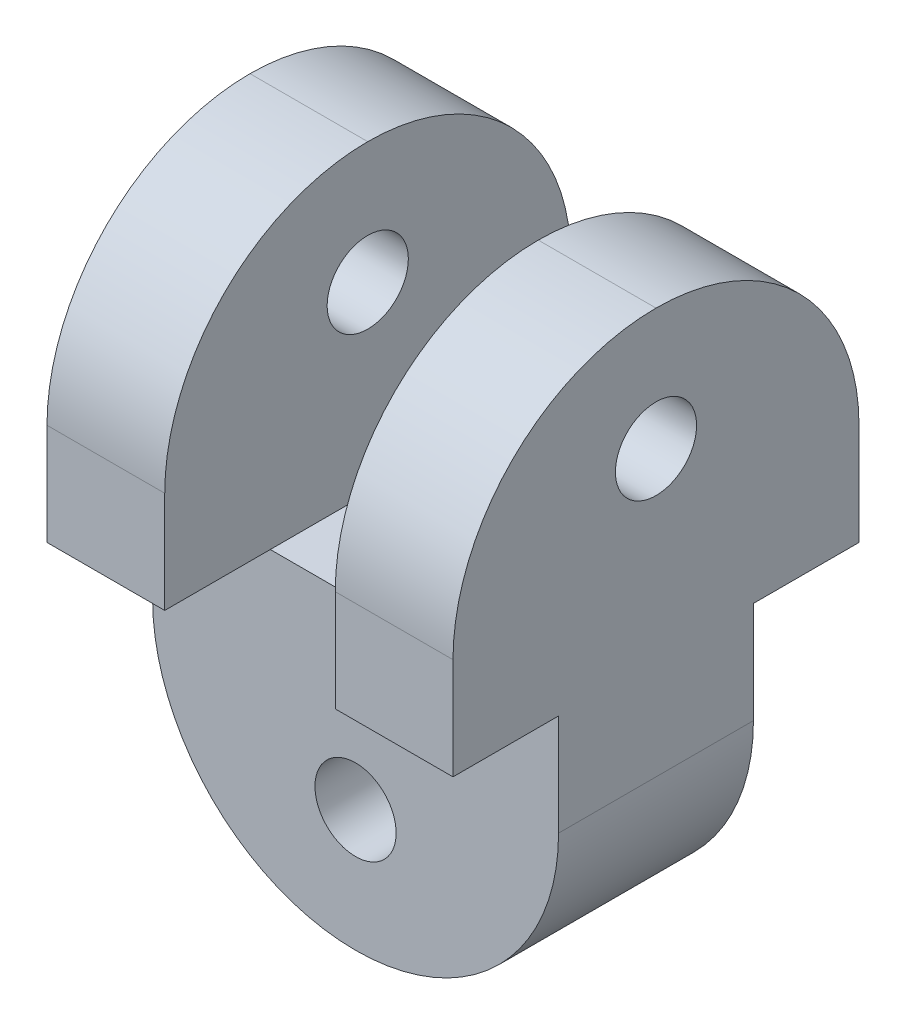
ISO-10303-21;
HEADER;
FILE_DESCRIPTION(('STEP AP214'),'2;1');
FILE_NAME('part.step','',(''),(''),'','','');
FILE_SCHEMA(('AUTOMOTIVE_DESIGN { 1 0 10303 214 1 1 1 1 }'));
ENDSEC;
DATA;
#1=APPLICATION_CONTEXT('core data for automotive mechanical design processes');
#2=APPLICATION_PROTOCOL_DEFINITION('international standard','automotive_design',2000,#1);
#3=PRODUCT_CONTEXT('',#1,'mechanical');
#4=PRODUCT('Part','Part','',(#3));
#5=PRODUCT_RELATED_PRODUCT_CATEGORY('part','',(#4));
#6=PRODUCT_DEFINITION_FORMATION('','',#4);
#7=PRODUCT_DEFINITION_CONTEXT('part definition',#1,'design');
#8=PRODUCT_DEFINITION('design','',#6,#7);
#9=PRODUCT_DEFINITION_SHAPE('','',#8);
#10=(LENGTH_UNIT() NAMED_UNIT(*) SI_UNIT(.MILLI.,.METRE.));
#11=(NAMED_UNIT(*) PLANE_ANGLE_UNIT() SI_UNIT($,.RADIAN.));
#12=(NAMED_UNIT(*) SI_UNIT($,.STERADIAN.) SOLID_ANGLE_UNIT());
#13=UNCERTAINTY_MEASURE_WITH_UNIT(LENGTH_MEASURE(1.E-05),#10,'distance_accuracy_value','');
#14=(GEOMETRIC_REPRESENTATION_CONTEXT(3) GLOBAL_UNCERTAINTY_ASSIGNED_CONTEXT((#13)) GLOBAL_UNIT_ASSIGNED_CONTEXT((#10,
#11,#12)) REPRESENTATION_CONTEXT('',''));
#15=CARTESIAN_POINT('',(0.,0.,0.));
#16=DIRECTION('',(0.,0.,1.));
#17=DIRECTION('',(1.,0.,0.));
#18=AXIS2_PLACEMENT_3D('',#15,#16,#17);
#19=CARTESIAN_POINT('',(0.,0.,10.));
#20=DIRECTION('',(0.,0.,1.));
#21=DIRECTION('',(1.,0.,0.));
#22=AXIS2_PLACEMENT_3D('',#19,#20,#21);
#23=PLANE('',#22);
#24=DIRECTION('',(0.,1.,0.));
#25=VECTOR('',#24,1.);
#26=CARTESIAN_POINT('',(5.,-7.50000000000001,10.));
#27=LINE('',#26,#25);
#28=CARTESIAN_POINT('',(5.,0.,10.));
#29=VERTEX_POINT('',#28);
#30=CARTESIAN_POINT('',(5.,2.49999999999999,10.));
#31=VERTEX_POINT('',#30);
#32=EDGE_CURVE('E239',#29,#31,#27,.T.);
#33=ORIENTED_EDGE('',*,*,#32,.T.);
#34=DIRECTION('',(-1.,0.,0.));
#35=VECTOR('',#34,1.);
#36=CARTESIAN_POINT('',(2.1,2.49999999999999,10.));
#37=LINE('',#36,#35);
#38=CARTESIAN_POINT('',(2.1,2.49999999999999,10.));
#39=VERTEX_POINT('',#38);
#40=EDGE_CURVE('E286',#31,#39,#37,.T.);
#41=ORIENTED_EDGE('',*,*,#40,.T.);
#42=DIRECTION('',(0.,-1.,0.));
#43=VECTOR('',#42,1.);
#44=CARTESIAN_POINT('',(2.1,7.49999999999999,10.));
#45=LINE('',#44,#43);
#46=CARTESIAN_POINT('',(2.1,0.,10.));
#47=VERTEX_POINT('',#46);
#48=EDGE_CURVE('E231',#39,#47,#45,.T.);
#49=ORIENTED_EDGE('',*,*,#48,.T.);
#50=DIRECTION('',(1.,0.,0.));
#51=VECTOR('',#50,1.);
#52=CARTESIAN_POINT('',(-5.,0.,10.));
#53=LINE('',#52,#51);
#54=EDGE_CURVE('E177',#47,#29,#53,.T.);
#55=ORIENTED_EDGE('',*,*,#54,.T.);
#56=EDGE_LOOP('',(#33,#41,#49,#55));
#57=FACE_BOUND('',#56,.T.);
#58=ADVANCED_FACE('F38',(#57),#23,.T.);
#59=CARTESIAN_POINT('',(0.,0.,0.));
#60=DIRECTION('',(0.,0.,1.));
#61=DIRECTION('',(1.,0.,0.));
#62=AXIS2_PLACEMENT_3D('',#59,#60,#61);
#63=PLANE('',#62);
#64=DIRECTION('',(0.,-1.,0.));
#65=VECTOR('',#64,1.);
#66=CARTESIAN_POINT('',(2.1,7.49999999999999,0.));
#67=LINE('',#66,#65);
#68=CARTESIAN_POINT('',(2.1,2.49999999999999,0.));
#69=VERTEX_POINT('',#68);
#70=CARTESIAN_POINT('',(2.1,0.,0.));
#71=VERTEX_POINT('',#70);
#72=EDGE_CURVE('E230',#69,#71,#67,.T.);
#73=ORIENTED_EDGE('',*,*,#72,.F.);
#74=DIRECTION('',(-1.,0.,0.));
#75=VECTOR('',#74,1.);
#76=CARTESIAN_POINT('',(0.,2.49999999999999,0.));
#77=LINE('',#76,#75);
#78=CARTESIAN_POINT('',(5.,2.49999999999999,0.));
#79=VERTEX_POINT('',#78);
#80=EDGE_CURVE('E277',#69,#79,#77,.F.);
#81=ORIENTED_EDGE('',*,*,#80,.T.);
#82=DIRECTION('',(0.,1.,0.));
#83=VECTOR('',#82,1.);
#84=CARTESIAN_POINT('',(5.,-7.50000000000001,0.));
#85=LINE('',#84,#83);
#86=CARTESIAN_POINT('',(5.,0.,0.));
#87=VERTEX_POINT('',#86);
#88=EDGE_CURVE('E234',#87,#79,#85,.T.);
#89=ORIENTED_EDGE('',*,*,#88,.F.);
#90=DIRECTION('',(1.,0.,0.));
#91=VECTOR('',#90,1.);
#92=CARTESIAN_POINT('',(-5.,0.,0.));
#93=LINE('',#92,#91);
#94=EDGE_CURVE('E199',#71,#87,#93,.T.);
#95=ORIENTED_EDGE('',*,*,#94,.F.);
#96=EDGE_LOOP('',(#73,#81,#89,#95));
#97=FACE_BOUND('',#96,.T.);
#98=ADVANCED_FACE('F333',(#97),#63,.F.);
#99=DIRECTION('',(0.,1.,0.));
#100=VECTOR('',#99,1.);
#101=CARTESIAN_POINT('',(-2.1,7.49999999999999,10.));
#102=LINE('',#101,#100);
#103=CARTESIAN_POINT('',(-2.1,0.,10.));
#104=VERTEX_POINT('',#103);
#105=CARTESIAN_POINT('',(-2.1,2.49999999999999,10.));
#106=VERTEX_POINT('',#105);
#107=EDGE_CURVE('E233',#104,#106,#102,.T.);
#108=ORIENTED_EDGE('',*,*,#107,.T.);
#109=DIRECTION('',(-1.,0.,0.));
#110=VECTOR('',#109,1.);
#111=CARTESIAN_POINT('',(-5.,2.49999999999999,10.));
#112=LINE('',#111,#110);
#113=CARTESIAN_POINT('',(-5.,2.49999999999999,10.));
#114=VERTEX_POINT('',#113);
#115=EDGE_CURVE('E288',#106,#114,#112,.T.);
#116=ORIENTED_EDGE('',*,*,#115,.T.);
#117=DIRECTION('',(0.,-1.,0.));
#118=VECTOR('',#117,1.);
#119=CARTESIAN_POINT('',(-5.,-7.50000000000001,10.));
#120=LINE('',#119,#118);
#121=CARTESIAN_POINT('',(-5.,0.,10.));
#122=VERTEX_POINT('',#121);
#123=EDGE_CURVE('E237',#114,#122,#120,.T.);
#124=ORIENTED_EDGE('',*,*,#123,.T.);
#125=EDGE_CURVE('E183',#122,#104,#53,.T.);
#126=ORIENTED_EDGE('',*,*,#125,.T.);
#127=EDGE_LOOP('',(#108,#116,#124,#126));
#128=FACE_BOUND('',#127,.T.);
#129=ADVANCED_FACE('F350',(#128),#23,.T.);
#130=DIRECTION('',(0.,-1.,0.));
#131=VECTOR('',#130,1.);
#132=CARTESIAN_POINT('',(-5.,-7.50000000000001,0.));
#133=LINE('',#132,#131);
#134=CARTESIAN_POINT('',(-5.,2.49999999999999,0.));
#135=VERTEX_POINT('',#134);
#136=CARTESIAN_POINT('',(-5.,0.,0.));
#137=VERTEX_POINT('',#136);
#138=EDGE_CURVE('E247',#135,#137,#133,.T.);
#139=ORIENTED_EDGE('',*,*,#138,.F.);
#140=DIRECTION('',(-1.,0.,0.));
#141=VECTOR('',#140,1.);
#142=CARTESIAN_POINT('',(0.,2.49999999999999,0.));
#143=LINE('',#142,#141);
#144=CARTESIAN_POINT('',(-2.1,2.49999999999999,0.));
#145=VERTEX_POINT('',#144);
#146=EDGE_CURVE('E266',#135,#145,#143,.F.);
#147=ORIENTED_EDGE('',*,*,#146,.T.);
#148=DIRECTION('',(0.,1.,0.));
#149=VECTOR('',#148,1.);
#150=CARTESIAN_POINT('',(-2.1,7.49999999999999,0.));
#151=LINE('',#150,#149);
#152=CARTESIAN_POINT('',(-2.1,0.,0.));
#153=VERTEX_POINT('',#152);
#154=EDGE_CURVE('E244',#153,#145,#151,.T.);
#155=ORIENTED_EDGE('',*,*,#154,.F.);
#156=EDGE_CURVE('E209',#137,#153,#93,.T.);
#157=ORIENTED_EDGE('',*,*,#156,.F.);
#158=EDGE_LOOP('',(#139,#147,#155,#157));
#159=FACE_BOUND('',#158,.T.);
#160=ADVANCED_FACE('F365',(#159),#63,.F.);
#161=CARTESIAN_POINT('',(2.1,7.49999999999999,10.));
#162=DIRECTION('',(1.,0.,0.));
#163=DIRECTION('',(0.,1.,0.));
#164=AXIS2_PLACEMENT_3D('',#161,#162,#163);
#165=PLANE('',#164);
#166=CARTESIAN_POINT('',(2.1,4.49999999999999,5.));
#167=DIRECTION('',(1.,0.,0.));
#168=DIRECTION('',(0.,1.,0.));
#169=AXIS2_PLACEMENT_3D('',#166,#167,#168);
#170=CIRCLE('',#169,1.);
#171=CARTESIAN_POINT('',(2.1,5.49999999999999,5.));
#172=VERTEX_POINT('',#171);
#173=EDGE_CURVE('E220',#172,#172,#170,.T.);
#174=ORIENTED_EDGE('',*,*,#173,.T.);
#175=EDGE_LOOP('',(#174));
#176=FACE_BOUND('',#175,.T.);
#177=CARTESIAN_POINT('',(2.1,2.49999999999999,5.));
#178=DIRECTION('',(1.,0.,0.));
#179=DIRECTION('',(0.,1.,0.));
#180=AXIS2_PLACEMENT_3D('',#177,#178,#179);
#181=CIRCLE('',#180,5.);
#182=CARTESIAN_POINT('',(2.1,7.49999999999999,5.));
#183=VERTEX_POINT('',#182);
#184=EDGE_CURVE('E273',#39,#183,#181,.F.);
#185=ORIENTED_EDGE('',*,*,#184,.T.);
#186=CARTESIAN_POINT('',(2.1,2.49999999999999,5.));
#187=DIRECTION('',(1.,0.,0.));
#188=DIRECTION('',(0.,1.,0.));
#189=AXIS2_PLACEMENT_3D('',#186,#187,#188);
#190=CIRCLE('',#189,5.);
#191=EDGE_CURVE('E275',#183,#69,#190,.F.);
#192=ORIENTED_EDGE('',*,*,#191,.T.);
#193=ORIENTED_EDGE('',*,*,#72,.T.);
#194=DIRECTION('',(0.,0.,1.));
#195=VECTOR('',#194,1.);
#196=CARTESIAN_POINT('',(2.1,0.,9.99999999999999));
#197=LINE('',#196,#195);
#198=CARTESIAN_POINT('',(2.1,0.,2.6));
#199=VERTEX_POINT('',#198);
#200=EDGE_CURVE('E227',#71,#199,#197,.T.);
#201=ORIENTED_EDGE('',*,*,#200,.T.);
#202=DIRECTION('',(0.,0.,-1.));
#203=VECTOR('',#202,1.);
#204=CARTESIAN_POINT('',(2.1,0.,10.));
#205=LINE('',#204,#203);
#206=CARTESIAN_POINT('',(2.1,0.,7.4));
#207=VERTEX_POINT('',#206);
#208=EDGE_CURVE('E254',#207,#199,#205,.T.);
#209=ORIENTED_EDGE('',*,*,#208,.F.);
#210=EDGE_CURVE('E255',#47,#207,#205,.T.);
#211=ORIENTED_EDGE('',*,*,#210,.F.);
#212=ORIENTED_EDGE('',*,*,#48,.F.);
#213=EDGE_LOOP('',(#185,#192,#193,#201,#209,#211,#212));
#214=FACE_BOUND('',#213,.T.);
#215=ADVANCED_FACE('F322',(#176,#214),#165,.F.);
#216=CARTESIAN_POINT('',(-2.1,0.,10.));
#217=DIRECTION('',(0.,-1.,0.));
#218=DIRECTION('',(0.,0.,-1.));
#219=AXIS2_PLACEMENT_3D('',#216,#217,#218);
#220=PLANE('',#219);
#221=DIRECTION('',(0.,0.,-1.));
#222=VECTOR('',#221,1.);
#223=CARTESIAN_POINT('',(-2.1,0.,10.));
#224=LINE('',#223,#222);
#225=CARTESIAN_POINT('',(-2.1,0.,7.4));
#226=VERTEX_POINT('',#225);
#227=CARTESIAN_POINT('',(-2.1,0.,2.6));
#228=VERTEX_POINT('',#227);
#229=EDGE_CURVE('E242',#226,#228,#224,.T.);
#230=ORIENTED_EDGE('',*,*,#229,.F.);
#231=DIRECTION('',(1.,0.,0.));
#232=VECTOR('',#231,1.);
#233=CARTESIAN_POINT('',(-5.,0.,7.4));
#234=LINE('',#233,#232);
#235=EDGE_CURVE('E174',#226,#207,#234,.T.);
#236=ORIENTED_EDGE('',*,*,#235,.T.);
#237=ORIENTED_EDGE('',*,*,#208,.T.);
#238=DIRECTION('',(1.,0.,0.));
#239=VECTOR('',#238,1.);
#240=CARTESIAN_POINT('',(-5.,0.,2.6));
#241=LINE('',#240,#239);
#242=EDGE_CURVE('E207',#228,#199,#241,.T.);
#243=ORIENTED_EDGE('',*,*,#242,.F.);
#244=EDGE_LOOP('',(#230,#236,#237,#243));
#245=FACE_BOUND('',#244,.T.);
#246=ADVANCED_FACE('F345',(#245),#220,.F.);
#247=CARTESIAN_POINT('',(-2.1,7.49999999999999,10.));
#248=DIRECTION('',(-1.,0.,0.));
#249=DIRECTION('',(0.,-1.,0.));
#250=AXIS2_PLACEMENT_3D('',#247,#248,#249);
#251=PLANE('',#250);
#252=CARTESIAN_POINT('',(-2.1,4.49999999999999,5.));
#253=DIRECTION('',(-1.,0.,0.));
#254=DIRECTION('',(0.,-1.,0.));
#255=AXIS2_PLACEMENT_3D('',#252,#253,#254);
#256=CIRCLE('',#255,1.);
#257=CARTESIAN_POINT('',(-2.1,3.49999999999999,5.));
#258=VERTEX_POINT('',#257);
#259=EDGE_CURVE('E217',#258,#258,#256,.T.);
#260=ORIENTED_EDGE('',*,*,#259,.T.);
#261=EDGE_LOOP('',(#260));
#262=FACE_BOUND('',#261,.T.);
#263=ORIENTED_EDGE('',*,*,#154,.T.);
#264=CARTESIAN_POINT('',(-2.1,2.49999999999999,5.));
#265=DIRECTION('',(-1.,0.,0.));
#266=DIRECTION('',(0.,-1.,0.));
#267=AXIS2_PLACEMENT_3D('',#264,#265,#266);
#268=CIRCLE('',#267,5.);
#269=CARTESIAN_POINT('',(-2.1,7.49999999999999,5.));
#270=VERTEX_POINT('',#269);
#271=EDGE_CURVE('E271',#145,#270,#268,.F.);
#272=ORIENTED_EDGE('',*,*,#271,.T.);
#273=CARTESIAN_POINT('',(-2.1,2.49999999999999,5.));
#274=DIRECTION('',(-1.,0.,0.));
#275=DIRECTION('',(0.,-1.,0.));
#276=AXIS2_PLACEMENT_3D('',#273,#274,#275);
#277=CIRCLE('',#276,5.);
#278=EDGE_CURVE('E269',#270,#106,#277,.F.);
#279=ORIENTED_EDGE('',*,*,#278,.T.);
#280=ORIENTED_EDGE('',*,*,#107,.F.);
#281=EDGE_CURVE('E251',#104,#226,#224,.T.);
#282=ORIENTED_EDGE('',*,*,#281,.T.);
#283=ORIENTED_EDGE('',*,*,#229,.T.);
#284=DIRECTION('',(0.,0.,-1.));
#285=VECTOR('',#284,1.);
#286=CARTESIAN_POINT('',(-2.1,0.,9.99999999999999));
#287=LINE('',#286,#285);
#288=EDGE_CURVE('E224',#228,#153,#287,.T.);
#289=ORIENTED_EDGE('',*,*,#288,.T.);
#290=EDGE_LOOP('',(#263,#272,#279,#280,#282,#283,#289));
#291=FACE_BOUND('',#290,.T.);
#292=ADVANCED_FACE('F348',(#262,#291),#251,.F.);
#293=CARTESIAN_POINT('',(-5.,-7.50000000000001,10.));
#294=DIRECTION('',(1.,0.,0.));
#295=DIRECTION('',(0.,0.,-1.));
#296=AXIS2_PLACEMENT_3D('',#293,#294,#295);
#297=PLANE('',#296);
#298=CARTESIAN_POINT('',(-5.,4.49999999999999,5.));
#299=DIRECTION('',(1.,0.,0.));
#300=DIRECTION('',(0.,1.,0.));
#301=AXIS2_PLACEMENT_3D('',#298,#299,#300);
#302=CIRCLE('',#301,1.);
#303=CARTESIAN_POINT('',(-5.,5.49999999999999,5.));
#304=VERTEX_POINT('',#303);
#305=EDGE_CURVE('E203',#304,#304,#302,.T.);
#306=ORIENTED_EDGE('',*,*,#305,.T.);
#307=EDGE_LOOP('',(#306));
#308=FACE_BOUND('',#307,.T.);
#309=CARTESIAN_POINT('',(-5.,2.49999999999999,5.));
#310=DIRECTION('',(1.,0.,0.));
#311=DIRECTION('',(0.,0.,-1.));
#312=AXIS2_PLACEMENT_3D('',#309,#310,#311);
#313=CIRCLE('',#312,5.);
#314=CARTESIAN_POINT('',(-5.,7.49999999999999,5.));
#315=VERTEX_POINT('',#314);
#316=EDGE_CURVE('E262',#114,#315,#313,.F.);
#317=ORIENTED_EDGE('',*,*,#316,.T.);
#318=CARTESIAN_POINT('',(-5.,2.49999999999999,5.));
#319=DIRECTION('',(1.,0.,0.));
#320=DIRECTION('',(0.,0.,-1.));
#321=AXIS2_PLACEMENT_3D('',#318,#319,#320);
#322=CIRCLE('',#321,5.);
#323=EDGE_CURVE('E264',#315,#135,#322,.F.);
#324=ORIENTED_EDGE('',*,*,#323,.T.);
#325=ORIENTED_EDGE('',*,*,#138,.T.);
#326=DIRECTION('',(0.,0.,1.));
#327=VECTOR('',#326,1.);
#328=CARTESIAN_POINT('',(-5.,0.,0.));
#329=LINE('',#328,#327);
#330=CARTESIAN_POINT('',(-5.,0.,2.6));
#331=VERTEX_POINT('',#330);
#332=EDGE_CURVE('E193',#137,#331,#329,.T.);
#333=ORIENTED_EDGE('',*,*,#332,.T.);
#334=DIRECTION('',(0.,-1.,0.));
#335=VECTOR('',#334,1.);
#336=CARTESIAN_POINT('',(-5.,-7.50000000000001,2.6));
#337=LINE('',#336,#335);
#338=CARTESIAN_POINT('',(-5.,-2.50000000000001,2.6));
#339=VERTEX_POINT('',#338);
#340=EDGE_CURVE('E196',#331,#339,#337,.T.);
#341=ORIENTED_EDGE('',*,*,#340,.T.);
#342=DIRECTION('',(0.,0.,-1.));
#343=VECTOR('',#342,1.);
#344=CARTESIAN_POINT('',(-5.,-2.50000000000001,10.));
#345=LINE('',#344,#343);
#346=CARTESIAN_POINT('',(-5.,-2.50000000000001,7.4));
#347=VERTEX_POINT('',#346);
#348=EDGE_CURVE('E166',#339,#347,#345,.F.);
#349=ORIENTED_EDGE('',*,*,#348,.T.);
#350=DIRECTION('',(0.,1.,0.));
#351=VECTOR('',#350,1.);
#352=CARTESIAN_POINT('',(-5.,-7.50000000000001,7.4));
#353=LINE('',#352,#351);
#354=CARTESIAN_POINT('',(-5.,0.,7.4));
#355=VERTEX_POINT('',#354);
#356=EDGE_CURVE('E158',#347,#355,#353,.T.);
#357=ORIENTED_EDGE('',*,*,#356,.T.);
#358=DIRECTION('',(0.,0.,1.));
#359=VECTOR('',#358,1.);
#360=CARTESIAN_POINT('',(-5.,0.,10.));
#361=LINE('',#360,#359);
#362=EDGE_CURVE('E163',#355,#122,#361,.T.);
#363=ORIENTED_EDGE('',*,*,#362,.T.);
#364=ORIENTED_EDGE('',*,*,#123,.F.);
#365=EDGE_LOOP('',(#317,#324,#325,#333,#341,#349,#357,#363,#364));
#366=FACE_BOUND('',#365,.T.);
#367=ADVANCED_FACE('F160',(#308,#366),#297,.F.);
#368=CARTESIAN_POINT('',(5.,-7.50000000000001,10.));
#369=DIRECTION('',(-1.,0.,0.));
#370=DIRECTION('',(0.,-1.,0.));
#371=AXIS2_PLACEMENT_3D('',#368,#369,#370);
#372=PLANE('',#371);
#373=CARTESIAN_POINT('',(5.,4.49999999999999,5.));
#374=DIRECTION('',(1.,0.,0.));
#375=DIRECTION('',(0.,1.,0.));
#376=AXIS2_PLACEMENT_3D('',#373,#374,#375);
#377=CIRCLE('',#376,1.);
#378=CARTESIAN_POINT('',(5.,5.49999999999999,5.));
#379=VERTEX_POINT('',#378);
#380=EDGE_CURVE('E213',#379,#379,#377,.T.);
#381=ORIENTED_EDGE('',*,*,#380,.F.);
#382=EDGE_LOOP('',(#381));
#383=FACE_BOUND('',#382,.T.);
#384=ORIENTED_EDGE('',*,*,#88,.T.);
#385=CARTESIAN_POINT('',(5.,2.49999999999999,5.));
#386=DIRECTION('',(-1.,0.,0.));
#387=DIRECTION('',(0.,-1.,0.));
#388=AXIS2_PLACEMENT_3D('',#385,#386,#387);
#389=CIRCLE('',#388,5.);
#390=CARTESIAN_POINT('',(5.,7.49999999999999,5.));
#391=VERTEX_POINT('',#390);
#392=EDGE_CURVE('E284',#79,#391,#389,.F.);
#393=ORIENTED_EDGE('',*,*,#392,.T.);
#394=CARTESIAN_POINT('',(5.,2.49999999999999,5.));
#395=DIRECTION('',(-1.,0.,0.));
#396=DIRECTION('',(0.,-1.,0.));
#397=AXIS2_PLACEMENT_3D('',#394,#395,#396);
#398=CIRCLE('',#397,5.);
#399=EDGE_CURVE('E282',#391,#31,#398,.F.);
#400=ORIENTED_EDGE('',*,*,#399,.T.);
#401=ORIENTED_EDGE('',*,*,#32,.F.);
#402=DIRECTION('',(0.,0.,1.));
#403=VECTOR('',#402,1.);
#404=CARTESIAN_POINT('',(5.,0.,10.));
#405=LINE('',#404,#403);
#406=CARTESIAN_POINT('',(5.,0.,7.4));
#407=VERTEX_POINT('',#406);
#408=EDGE_CURVE('E167',#407,#29,#405,.T.);
#409=ORIENTED_EDGE('',*,*,#408,.F.);
#410=DIRECTION('',(0.,1.,0.));
#411=VECTOR('',#410,1.);
#412=CARTESIAN_POINT('',(5.,-7.50000000000001,7.4));
#413=LINE('',#412,#411);
#414=CARTESIAN_POINT('',(5.,-2.50000000000001,7.4));
#415=VERTEX_POINT('',#414);
#416=EDGE_CURVE('E187',#415,#407,#413,.T.);
#417=ORIENTED_EDGE('',*,*,#416,.F.);
#418=DIRECTION('',(0.,0.,-1.));
#419=VECTOR('',#418,1.);
#420=CARTESIAN_POINT('',(5.,-2.50000000000001,10.));
#421=LINE('',#420,#419);
#422=CARTESIAN_POINT('',(5.,-2.50000000000001,2.6));
#423=VERTEX_POINT('',#422);
#424=EDGE_CURVE('E280',#415,#423,#421,.T.);
#425=ORIENTED_EDGE('',*,*,#424,.T.);
#426=DIRECTION('',(0.,-1.,0.));
#427=VECTOR('',#426,1.);
#428=CARTESIAN_POINT('',(5.,-7.50000000000001,2.6));
#429=LINE('',#428,#427);
#430=CARTESIAN_POINT('',(5.,0.,2.6));
#431=VERTEX_POINT('',#430);
#432=EDGE_CURVE('E197',#431,#423,#429,.T.);
#433=ORIENTED_EDGE('',*,*,#432,.F.);
#434=DIRECTION('',(0.,0.,1.));
#435=VECTOR('',#434,1.);
#436=CARTESIAN_POINT('',(5.,0.,0.));
#437=LINE('',#436,#435);
#438=EDGE_CURVE('E200',#87,#431,#437,.T.);
#439=ORIENTED_EDGE('',*,*,#438,.F.);
#440=EDGE_LOOP('',(#384,#393,#400,#401,#409,#417,#425,#433,#439));
#441=FACE_BOUND('',#440,.T.);
#442=ADVANCED_FACE('F309',(#383,#441),#372,.F.);
#443=CARTESIAN_POINT('',(-5.,0.,0.));
#444=DIRECTION('',(0.,1.,0.));
#445=DIRECTION('',(0.,0.,1.));
#446=AXIS2_PLACEMENT_3D('',#443,#444,#445);
#447=PLANE('',#446);
#448=ORIENTED_EDGE('',*,*,#94,.T.);
#449=ORIENTED_EDGE('',*,*,#438,.T.);
#450=EDGE_CURVE('E208',#199,#431,#241,.T.);
#451=ORIENTED_EDGE('',*,*,#450,.F.);
#452=ORIENTED_EDGE('',*,*,#200,.F.);
#453=EDGE_LOOP('',(#448,#449,#451,#452));
#454=FACE_BOUND('',#453,.T.);
#455=ADVANCED_FACE('F337',(#454),#447,.F.);
#456=EDGE_CURVE('E189',#331,#228,#241,.T.);
#457=ORIENTED_EDGE('',*,*,#456,.F.);
#458=ORIENTED_EDGE('',*,*,#332,.F.);
#459=ORIENTED_EDGE('',*,*,#156,.T.);
#460=ORIENTED_EDGE('',*,*,#288,.F.);
#461=EDGE_LOOP('',(#457,#458,#459,#460));
#462=FACE_BOUND('',#461,.T.);
#463=ADVANCED_FACE('F368',(#462),#447,.F.);
#464=CARTESIAN_POINT('',(-5.,-7.50000000000001,2.6));
#465=DIRECTION('',(0.,0.,1.));
#466=DIRECTION('',(0.,-1.,0.));
#467=AXIS2_PLACEMENT_3D('',#464,#465,#466);
#468=PLANE('',#467);
#469=CARTESIAN_POINT('',(0.,-4.50000000000001,2.6));
#470=DIRECTION('',(0.,0.,1.));
#471=DIRECTION('',(0.,-1.,0.));
#472=AXIS2_PLACEMENT_3D('',#469,#470,#471);
#473=CIRCLE('',#472,1.);
#474=CARTESIAN_POINT('',(0.,-5.50000000000001,2.6));
#475=VERTEX_POINT('',#474);
#476=EDGE_CURVE('E191',#475,#475,#473,.T.);
#477=ORIENTED_EDGE('',*,*,#476,.T.);
#478=EDGE_LOOP('',(#477));
#479=FACE_BOUND('',#478,.T.);
#480=CARTESIAN_POINT('',(0.,-2.50000000000001,2.6));
#481=DIRECTION('',(0.,0.,1.));
#482=DIRECTION('',(0.,-1.,0.));
#483=AXIS2_PLACEMENT_3D('',#480,#481,#482);
#484=CIRCLE('',#483,5.);
#485=CARTESIAN_POINT('',(0.,-7.50000000000001,2.6));
#486=VERTEX_POINT('',#485);
#487=EDGE_CURVE('E61',#423,#486,#484,.F.);
#488=ORIENTED_EDGE('',*,*,#487,.T.);
#489=CARTESIAN_POINT('',(0.,-2.50000000000001,2.6));
#490=DIRECTION('',(0.,0.,1.));
#491=DIRECTION('',(0.,-1.,0.));
#492=AXIS2_PLACEMENT_3D('',#489,#490,#491);
#493=CIRCLE('',#492,5.);
#494=EDGE_CURVE('E291',#486,#339,#493,.F.);
#495=ORIENTED_EDGE('',*,*,#494,.T.);
#496=ORIENTED_EDGE('',*,*,#340,.F.);
#497=ORIENTED_EDGE('',*,*,#456,.T.);
#498=ORIENTED_EDGE('',*,*,#242,.T.);
#499=ORIENTED_EDGE('',*,*,#450,.T.);
#500=ORIENTED_EDGE('',*,*,#432,.T.);
#501=EDGE_LOOP('',(#488,#495,#496,#497,#498,#499,#500));
#502=FACE_BOUND('',#501,.T.);
#503=ADVANCED_FACE('F338',(#479,#502),#468,.F.);
#504=CARTESIAN_POINT('',(-5.,0.,10.));
#505=DIRECTION('',(0.,1.,0.));
#506=DIRECTION('',(0.,0.,1.));
#507=AXIS2_PLACEMENT_3D('',#504,#505,#506);
#508=PLANE('',#507);
#509=EDGE_CURVE('E179',#207,#407,#234,.T.);
#510=ORIENTED_EDGE('',*,*,#509,.T.);
#511=ORIENTED_EDGE('',*,*,#408,.T.);
#512=ORIENTED_EDGE('',*,*,#54,.F.);
#513=ORIENTED_EDGE('',*,*,#210,.T.);
#514=EDGE_LOOP('',(#510,#511,#512,#513));
#515=FACE_BOUND('',#514,.T.);
#516=ADVANCED_FACE('F315',(#515),#508,.F.);
#517=ORIENTED_EDGE('',*,*,#125,.F.);
#518=ORIENTED_EDGE('',*,*,#362,.F.);
#519=EDGE_CURVE('E170',#355,#226,#234,.T.);
#520=ORIENTED_EDGE('',*,*,#519,.T.);
#521=ORIENTED_EDGE('',*,*,#281,.F.);
#522=EDGE_LOOP('',(#517,#518,#520,#521));
#523=FACE_BOUND('',#522,.T.);
#524=ADVANCED_FACE('F181',(#523),#508,.F.);
#525=CARTESIAN_POINT('',(-5.,-7.50000000000001,7.4));
#526=DIRECTION('',(0.,0.,-1.));
#527=DIRECTION('',(0.,1.,0.));
#528=AXIS2_PLACEMENT_3D('',#525,#526,#527);
#529=PLANE('',#528);
#530=CARTESIAN_POINT('',(0.,-4.50000000000001,7.4));
#531=DIRECTION('',(0.,0.,-1.));
#532=DIRECTION('',(0.,1.,0.));
#533=AXIS2_PLACEMENT_3D('',#530,#531,#532);
#534=CIRCLE('',#533,1.);
#535=CARTESIAN_POINT('',(0.,-3.50000000000001,7.4));
#536=VERTEX_POINT('',#535);
#537=EDGE_CURVE('E221',#536,#536,#534,.T.);
#538=ORIENTED_EDGE('',*,*,#537,.T.);
#539=EDGE_LOOP('',(#538));
#540=FACE_BOUND('',#539,.T.);
#541=ORIENTED_EDGE('',*,*,#356,.F.);
#542=CARTESIAN_POINT('',(0.,-2.50000000000001,7.4));
#543=DIRECTION('',(0.,0.,-1.));
#544=DIRECTION('',(0.,1.,0.));
#545=AXIS2_PLACEMENT_3D('',#542,#543,#544);
#546=CIRCLE('',#545,5.);
#547=CARTESIAN_POINT('',(0.,-7.50000000000001,7.4));
#548=VERTEX_POINT('',#547);
#549=EDGE_CURVE('E11',#347,#548,#546,.F.);
#550=ORIENTED_EDGE('',*,*,#549,.T.);
#551=CARTESIAN_POINT('',(0.,-2.50000000000001,7.4));
#552=DIRECTION('',(0.,0.,-1.));
#553=DIRECTION('',(0.,1.,0.));
#554=AXIS2_PLACEMENT_3D('',#551,#552,#553);
#555=CIRCLE('',#554,5.);
#556=EDGE_CURVE('E47',#548,#415,#555,.F.);
#557=ORIENTED_EDGE('',*,*,#556,.T.);
#558=ORIENTED_EDGE('',*,*,#416,.T.);
#559=ORIENTED_EDGE('',*,*,#509,.F.);
#560=ORIENTED_EDGE('',*,*,#235,.F.);
#561=ORIENTED_EDGE('',*,*,#519,.F.);
#562=EDGE_LOOP('',(#541,#550,#557,#558,#559,#560,#561));
#563=FACE_BOUND('',#562,.T.);
#564=ADVANCED_FACE('F171',(#540,#563),#529,.F.);
#565=CARTESIAN_POINT('',(-5.,4.49999999999999,5.));
#566=DIRECTION('',(1.,0.,0.));
#567=DIRECTION('',(0.,1.,0.));
#568=AXIS2_PLACEMENT_3D('',#565,#566,#567);
#569=CYLINDRICAL_SURFACE('',#568,1.);
#570=ORIENTED_EDGE('',*,*,#380,.T.);
#571=EDGE_LOOP('',(#570));
#572=FACE_BOUND('',#571,.T.);
#573=ORIENTED_EDGE('',*,*,#173,.F.);
#574=EDGE_LOOP('',(#573));
#575=FACE_BOUND('',#574,.T.);
#576=ADVANCED_FACE('F450',(#572,#575),#569,.F.);
#577=ORIENTED_EDGE('',*,*,#305,.F.);
#578=EDGE_LOOP('',(#577));
#579=FACE_BOUND('',#578,.T.);
#580=ORIENTED_EDGE('',*,*,#259,.F.);
#581=EDGE_LOOP('',(#580));
#582=FACE_BOUND('',#581,.T.);
#583=ADVANCED_FACE('F443',(#579,#582),#569,.F.);
#584=CARTESIAN_POINT('',(0.,-4.50000000000001,10.));
#585=DIRECTION('',(0.,0.,-1.));
#586=DIRECTION('',(-1.,0.,0.));
#587=AXIS2_PLACEMENT_3D('',#584,#585,#586);
#588=CYLINDRICAL_SURFACE('',#587,1.);
#589=ORIENTED_EDGE('',*,*,#537,.F.);
#590=EDGE_LOOP('',(#589));
#591=FACE_BOUND('',#590,.T.);
#592=ORIENTED_EDGE('',*,*,#476,.F.);
#593=EDGE_LOOP('',(#592));
#594=FACE_BOUND('',#593,.T.);
#595=ADVANCED_FACE('F410',(#591,#594),#588,.F.);
#596=CARTESIAN_POINT('',(0.,2.49999999999999,5.));
#597=DIRECTION('',(1.,0.,0.));
#598=DIRECTION('',(0.,0.,-1.));
#599=AXIS2_PLACEMENT_3D('',#596,#597,#598);
#600=CYLINDRICAL_SURFACE('',#599,5.);
#601=ORIENTED_EDGE('',*,*,#115,.F.);
#602=ORIENTED_EDGE('',*,*,#278,.F.);
#603=DIRECTION('',(-1.,0.,0.));
#604=VECTOR('',#603,1.);
#605=CARTESIAN_POINT('',(-2.1,7.49999999999999,5.));
#606=LINE('',#605,#604);
#607=EDGE_CURVE('E216',#315,#270,#606,.F.);
#608=ORIENTED_EDGE('',*,*,#607,.F.);
#609=ORIENTED_EDGE('',*,*,#316,.F.);
#610=EDGE_LOOP('',(#601,#602,#608,#609));
#611=FACE_BOUND('',#610,.T.);
#612=ADVANCED_FACE('F355',(#611),#600,.T.);
#613=CARTESIAN_POINT('',(-2.1,2.49999999999999,5.));
#614=DIRECTION('',(-1.,0.,0.));
#615=DIRECTION('',(0.,0.,1.));
#616=AXIS2_PLACEMENT_3D('',#613,#614,#615);
#617=CYLINDRICAL_SURFACE('',#616,5.);
#618=ORIENTED_EDGE('',*,*,#271,.F.);
#619=ORIENTED_EDGE('',*,*,#146,.F.);
#620=ORIENTED_EDGE('',*,*,#323,.F.);
#621=ORIENTED_EDGE('',*,*,#607,.T.);
#622=EDGE_LOOP('',(#618,#619,#620,#621));
#623=FACE_BOUND('',#622,.T.);
#624=ADVANCED_FACE('F360',(#623),#617,.T.);
#625=CARTESIAN_POINT('',(0.,2.49999999999999,5.));
#626=DIRECTION('',(1.,0.,0.));
#627=DIRECTION('',(0.,1.,0.));
#628=AXIS2_PLACEMENT_3D('',#625,#626,#627);
#629=CYLINDRICAL_SURFACE('',#628,5.);
#630=ORIENTED_EDGE('',*,*,#40,.F.);
#631=ORIENTED_EDGE('',*,*,#399,.F.);
#632=DIRECTION('',(-1.,0.,0.));
#633=VECTOR('',#632,1.);
#634=CARTESIAN_POINT('',(5.,7.49999999999999,5.));
#635=LINE('',#634,#633);
#636=EDGE_CURVE('E295',#183,#391,#635,.F.);
#637=ORIENTED_EDGE('',*,*,#636,.F.);
#638=ORIENTED_EDGE('',*,*,#184,.F.);
#639=EDGE_LOOP('',(#630,#631,#637,#638));
#640=FACE_BOUND('',#639,.T.);
#641=ADVANCED_FACE('F325',(#640),#629,.T.);
#642=CARTESIAN_POINT('',(2.1,2.49999999999999,5.));
#643=DIRECTION('',(-1.,0.,0.));
#644=DIRECTION('',(0.,-1.,0.));
#645=AXIS2_PLACEMENT_3D('',#642,#643,#644);
#646=CYLINDRICAL_SURFACE('',#645,5.);
#647=ORIENTED_EDGE('',*,*,#392,.F.);
#648=ORIENTED_EDGE('',*,*,#80,.F.);
#649=ORIENTED_EDGE('',*,*,#191,.F.);
#650=ORIENTED_EDGE('',*,*,#636,.T.);
#651=EDGE_LOOP('',(#647,#648,#649,#650));
#652=FACE_BOUND('',#651,.T.);
#653=ADVANCED_FACE('F328',(#652),#646,.T.);
#654=CARTESIAN_POINT('',(0.,-2.50000000000001,10.));
#655=DIRECTION('',(0.,0.,-1.));
#656=DIRECTION('',(-1.,0.,0.));
#657=AXIS2_PLACEMENT_3D('',#654,#655,#656);
#658=CYLINDRICAL_SURFACE('',#657,5.);
#659=ORIENTED_EDGE('',*,*,#424,.F.);
#660=ORIENTED_EDGE('',*,*,#556,.F.);
#661=DIRECTION('',(0.,0.,-1.));
#662=VECTOR('',#661,1.);
#663=CARTESIAN_POINT('',(0.,-7.50000000000001,10.));
#664=LINE('',#663,#662);
#665=EDGE_CURVE('E42',#486,#548,#664,.F.);
#666=ORIENTED_EDGE('',*,*,#665,.F.);
#667=ORIENTED_EDGE('',*,*,#487,.F.);
#668=EDGE_LOOP('',(#659,#660,#666,#667));
#669=FACE_BOUND('',#668,.T.);
#670=ADVANCED_FACE('F40',(#669),#658,.T.);
#671=CARTESIAN_POINT('',(0.,-2.50000000000001,10.));
#672=DIRECTION('',(0.,0.,-1.));
#673=DIRECTION('',(-1.,0.,0.));
#674=AXIS2_PLACEMENT_3D('',#671,#672,#673);
#675=CYLINDRICAL_SURFACE('',#674,5.);
#676=ORIENTED_EDGE('',*,*,#549,.F.);
#677=ORIENTED_EDGE('',*,*,#348,.F.);
#678=ORIENTED_EDGE('',*,*,#494,.F.);
#679=ORIENTED_EDGE('',*,*,#665,.T.);
#680=EDGE_LOOP('',(#676,#677,#678,#679));
#681=FACE_BOUND('',#680,.T.);
#682=ADVANCED_FACE('F303',(#681),#675,.T.);
#683=CLOSED_SHELL('',(#58,#98,#129,#160,#215,#246,#292,#367,#442,#455,#463,#503,#516,#524,#564,
#576,#583,#595,#612,#624,#641,#653,#670,#682));
#684=MANIFOLD_SOLID_BREP('B2',#683);
#685=ADVANCED_BREP_SHAPE_REPRESENTATION('',(#18,#684),#14);
#686=SHAPE_DEFINITION_REPRESENTATION(#9,#685);
ENDSEC;
END-ISO-10303-21;
